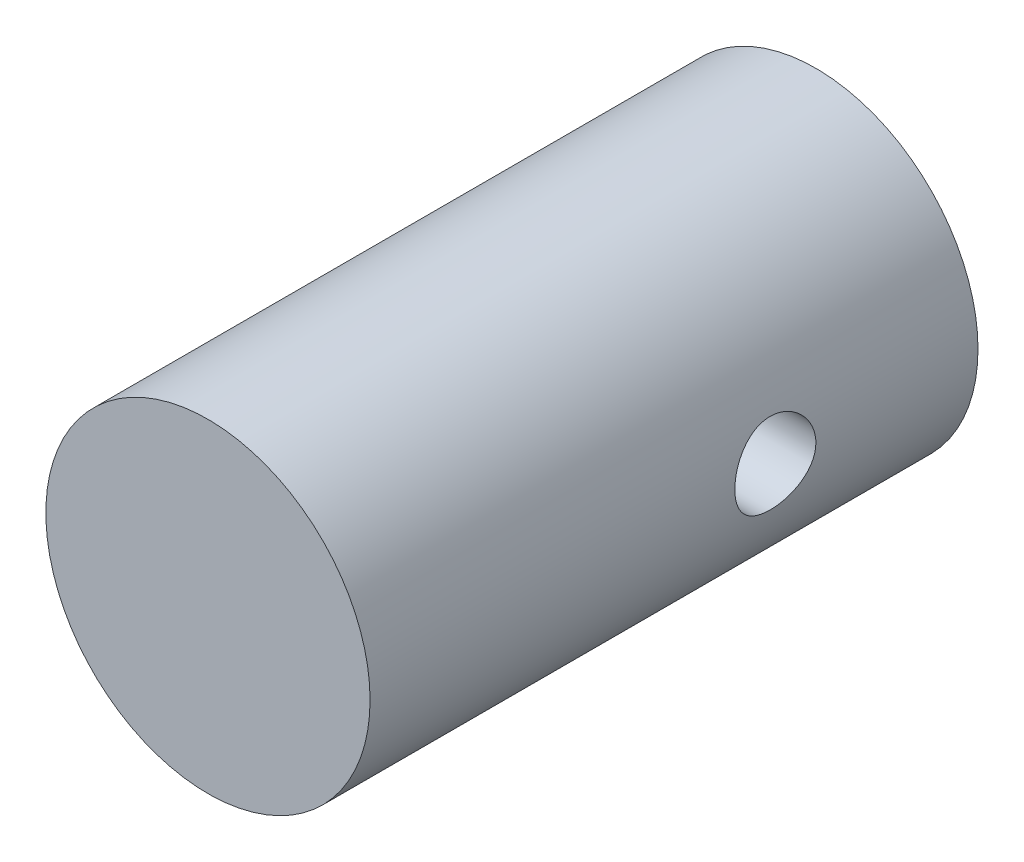
ISO-10303-21;
HEADER;
FILE_DESCRIPTION(('STEP AP214'),'2;1');
FILE_NAME('part.step','',(''),(''),'','','');
FILE_SCHEMA(('AUTOMOTIVE_DESIGN { 1 0 10303 214 1 1 1 1 }'));
ENDSEC;
DATA;
#1=APPLICATION_CONTEXT('core data for automotive mechanical design processes');
#2=APPLICATION_PROTOCOL_DEFINITION('international standard','automotive_design',2000,#1);
#3=PRODUCT_CONTEXT('',#1,'mechanical');
#4=PRODUCT('Part','Part','',(#3));
#5=PRODUCT_RELATED_PRODUCT_CATEGORY('part','',(#4));
#6=PRODUCT_DEFINITION_FORMATION('','',#4);
#7=PRODUCT_DEFINITION_CONTEXT('part definition',#1,'design');
#8=PRODUCT_DEFINITION('design','',#6,#7);
#9=PRODUCT_DEFINITION_SHAPE('','',#8);
#10=(LENGTH_UNIT() NAMED_UNIT(*) SI_UNIT(.MILLI.,.METRE.));
#11=(NAMED_UNIT(*) PLANE_ANGLE_UNIT() SI_UNIT($,.RADIAN.));
#12=(NAMED_UNIT(*) SI_UNIT($,.STERADIAN.) SOLID_ANGLE_UNIT());
#13=UNCERTAINTY_MEASURE_WITH_UNIT(LENGTH_MEASURE(1.E-05),#10,'distance_accuracy_value','');
#14=(GEOMETRIC_REPRESENTATION_CONTEXT(3) GLOBAL_UNCERTAINTY_ASSIGNED_CONTEXT((#13)) GLOBAL_UNIT_ASSIGNED_CONTEXT((#10,
#11,#12)) REPRESENTATION_CONTEXT('',''));
#15=CARTESIAN_POINT('',(0.,0.,0.));
#16=DIRECTION('',(0.,0.,1.));
#17=DIRECTION('',(1.,0.,0.));
#18=AXIS2_PLACEMENT_3D('',#15,#16,#17);
#19=CARTESIAN_POINT('',(-16.0700267929339,15.5717313885019,30.));
#20=DIRECTION('',(0.,0.,-1.));
#21=DIRECTION('',(-1.,0.,0.));
#22=AXIS2_PLACEMENT_3D('',#19,#20,#21);
#23=CYLINDRICAL_SURFACE('',#22,8.);
#24=CARTESIAN_POINT('',(-24.0700267929339,15.5717313885019,12.));
#25=CARTESIAN_POINT('',(-24.0700249245074,15.4612299369422,11.9999968990158));
#26=CARTESIAN_POINT('',(-24.0677145013583,15.3506938447275,11.990811265635));
#27=CARTESIAN_POINT('',(-24.0587216439992,15.1327896234745,11.954366464924));
#28=CARTESIAN_POINT('',(-24.0520367318669,15.0254233260075,11.9270970539495));
#29=CARTESIAN_POINT('',(-24.0350351440277,14.8170368922584,11.8554143287172));
#30=CARTESIAN_POINT('',(-24.024722830828,14.7160093039285,11.811021601713));
#31=CARTESIAN_POINT('',(-24.0015647103689,14.5228352126293,11.7064248132735));
#32=CARTESIAN_POINT('',(-23.988718817656,14.4306890093702,11.646220218508));
#33=CARTESIAN_POINT('',(-23.9615923074898,14.255995485434,11.5103989471278));
#34=CARTESIAN_POINT('',(-23.9472895549089,14.1736571350871,11.4345179000546));
#35=CARTESIAN_POINT('',(-23.9190083945064,14.0227328188974,11.270063726788));
#36=CARTESIAN_POINT('',(-23.9050300234655,13.9541484059029,11.1814891694041));
#37=CARTESIAN_POINT('',(-23.8787571355762,13.8316959981032,10.992539697684));
#38=CARTESIAN_POINT('',(-23.8664907191314,13.7780617672683,10.8920090255884));
#39=CARTESIAN_POINT('',(-23.8453533905075,13.6885355104342,10.6830021177866));
#40=CARTESIAN_POINT('',(-23.8364819355262,13.652640647915,10.5745271555573));
#41=CARTESIAN_POINT('',(-23.8233664822182,13.6003249394288,10.3550086690645));
#42=CARTESIAN_POINT('',(-23.8190333395607,13.5835283640591,10.244060138616));
#43=CARTESIAN_POINT('',(-23.8152182923951,13.5687156884133,10.0208419080009));
#44=CARTESIAN_POINT('',(-23.8157355986396,13.5706965327444,9.90857242574382));
#45=CARTESIAN_POINT('',(-23.8214828664915,13.5930826889823,9.6887789230062));
#46=CARTESIAN_POINT('',(-23.8265982996978,13.6130402682477,9.58120583804623));
#47=CARTESIAN_POINT('',(-23.8407829218815,13.6700991392979,9.37098526545192));
#48=CARTESIAN_POINT('',(-23.8498523925238,13.7072016524093,9.26833812929477));
#49=CARTESIAN_POINT('',(-23.871028311676,13.7978787512523,9.06968264499716));
#50=CARTESIAN_POINT('',(-23.8831644925315,13.8516158321913,8.97375177094724));
#51=CARTESIAN_POINT('',(-23.9090896042138,13.9739230204819,8.79210838699091));
#52=CARTESIAN_POINT('',(-23.9228788240623,14.0424957234234,8.70639766924367));
#53=CARTESIAN_POINT('',(-23.9510385334658,14.1948468222602,8.5450618457408));
#54=CARTESIAN_POINT('',(-23.9654143859739,14.2790030442807,8.46979401325153));
#55=CARTESIAN_POINT('',(-23.9927730006507,14.4589154984969,8.3343716767148));
#56=CARTESIAN_POINT('',(-24.0057557202594,14.5546720848913,8.27421763431525));
#57=CARTESIAN_POINT('',(-24.0289298875231,14.75557687026,8.17059921836749));
#58=CARTESIAN_POINT('',(-24.039111594637,14.860756197557,8.12719287966076));
#59=CARTESIAN_POINT('',(-24.0554656861528,15.0772300443113,8.05877692572057));
#60=CARTESIAN_POINT('',(-24.0616388374577,15.1885233896345,8.03376379144249));
#61=CARTESIAN_POINT('',(-24.0691667832189,15.4110114279818,8.00338991258822));
#62=CARTESIAN_POINT('',(-24.070640839711,15.5221357618509,7.9975426318996));
#63=CARTESIAN_POINT('',(-24.0689441904599,15.7437752215705,8.00433200274065));
#64=CARTESIAN_POINT('',(-24.0657739028252,15.8542904013613,8.01696699039885));
#65=CARTESIAN_POINT('',(-24.0552212079654,16.0698837468705,8.05996121118851));
#66=CARTESIAN_POINT('',(-24.0479019154114,16.1750182137935,8.09005501796932));
#67=CARTESIAN_POINT('',(-24.0298762147224,16.3787411117719,8.16680944537126));
#68=CARTESIAN_POINT('',(-24.0191694645325,16.4773288805454,8.21347173908423));
#69=CARTESIAN_POINT('',(-23.9952708986181,16.6670955677417,8.32298150516631));
#70=CARTESIAN_POINT('',(-23.9820383578264,16.7581119776163,8.38610148319568));
#71=CARTESIAN_POINT('',(-23.9546202487662,16.9284335400262,8.52638654506263));
#72=CARTESIAN_POINT('',(-23.94043451629,17.0077366671325,8.60355405282255));
#73=CARTESIAN_POINT('',(-23.9122795524109,17.1543854792655,8.77200261445929));
#74=CARTESIAN_POINT('',(-23.8983241820977,17.2213898786646,8.86358360400323));
#75=CARTESIAN_POINT('',(-23.8725985046304,17.3390790671855,9.05697684595429));
#76=CARTESIAN_POINT('',(-23.8608281004943,17.3897645807124,9.15878864394634));
#77=CARTESIAN_POINT('',(-23.8409347227295,17.4729999493142,9.36920762988411));
#78=CARTESIAN_POINT('',(-23.832790196826,17.5056572507073,9.47777017112535));
#79=CARTESIAN_POINT('',(-23.8210500474697,17.5521922684402,9.69907951718548));
#80=CARTESIAN_POINT('',(-23.8174534291997,17.5660740918067,9.81182540137666));
#81=CARTESIAN_POINT('',(-23.81529214232,17.5744495089472,10.0348280318069));
#82=CARTESIAN_POINT('',(-23.8165858959774,17.569488585542,10.145063246833));
#83=CARTESIAN_POINT('',(-23.8237322463718,17.5415677595857,10.3630718515573));
#84=CARTESIAN_POINT('',(-23.829584751492,17.5186082187509,10.4708452906849));
#85=CARTESIAN_POINT('',(-23.8451102687036,17.4556398144256,10.6802779454205));
#86=CARTESIAN_POINT('',(-23.8547603294181,17.415733261409,10.7819697403203));
#87=CARTESIAN_POINT('',(-23.876796869265,17.320084606642,10.9772871769516));
#88=CARTESIAN_POINT('',(-23.8891837278776,17.2643403085474,11.0709116975826));
#89=CARTESIAN_POINT('',(-23.9157019164474,17.1368883866847,11.2500728386694));
#90=CARTESIAN_POINT('',(-23.929870324024,17.0648022723849,11.3353347645653));
#91=CARTESIAN_POINT('',(-23.9581338228844,16.9074505500882,11.4927293930605));
#92=CARTESIAN_POINT('',(-23.9722288959614,16.8221818168501,11.564858973484));
#93=CARTESIAN_POINT('',(-23.9990622015694,16.6390215041053,11.6952150780861));
#94=CARTESIAN_POINT('',(-24.0117712378122,16.5409292849237,11.7531661515621));
#95=CARTESIAN_POINT('',(-24.0340924592688,16.3360861345158,11.8516632839207));
#96=CARTESIAN_POINT('',(-24.0437068622643,16.2293414730842,11.892221814198));
#97=CARTESIAN_POINT('',(-24.0573342538078,16.0309450594932,11.9487624404395));
#98=CARTESIAN_POINT('',(-24.0620612603031,15.940238283046,11.9679349907379));
#99=CARTESIAN_POINT('',(-24.0684081960266,15.7569394838836,11.9935545914959));
#100=CARTESIAN_POINT('',(-24.0700283589459,15.664347603492,12.0000025990737));
#101=CARTESIAN_POINT('',(-24.0700267929339,15.5717313885019,12.));
#102=B_SPLINE_CURVE_WITH_KNOTS('',3,(#24,#25,#26,#27,#28,#29,#30,#31,#32,#33,#34,#35,#36,#37,
#38,#39,#40,#41,#42,#43,#44,#45,#46,#47,#48,#49,#50,#51,#52,#53,#54,#55,#56,#57,#58,#59,#60,#61,
#62,#63,#64,#65,#66,#67,#68,#69,#70,#71,#72,#73,#74,#75,#76,#77,#78,#79,#80,#81,#82,#83,#84,#85,
#86,#87,#88,#89,#90,#91,#92,#93,#94,#95,#96,#97,#98,#99,#100,#101),.UNSPECIFIED.,.T.,.F.,(4,2,2,
2,2,2,2,2,2,2,2,2,2,2,2,2,2,2,2,2,2,2,2,2,2,2,2,2,2,2,2,2,2,2,2,2,2,2,4),(0.,0.33116494996252,
0.662517650351867,0.993473203048143,1.32443992022577,1.66152580582852,1.99864972773416,
2.34078196727743,2.68285948225825,3.01808393468093,3.3532538415469,3.68029996013785,
4.00736937959146,4.337740371696,4.66816921119312,5.00802001296454,5.34788119415424,
5.6889097201658,6.02987298255951,6.36211078603462,6.69431868154751,7.02160366023144,
7.34892169767481,7.68204783424897,8.01523150681786,8.35659345610395,8.69794025003772,
9.03723006156476,9.37644564340971,9.70591707202577,10.0353818794581,10.3628853408369,
10.6904342418696,11.0265276855097,11.3627009303165,11.7049624733721,12.0469781843289,
12.3245632392729,12.6021274139515),.UNSPECIFIED.);
#103=CARTESIAN_POINT('',(-24.0700267929339,15.5717313885019,12.));
#104=VERTEX_POINT('',#103);
#105=EDGE_CURVE('E37',#104,#104,#102,.T.);
#106=ORIENTED_EDGE('',*,*,#105,.T.);
#107=EDGE_LOOP('',(#106));
#108=FACE_BOUND('',#107,.T.);
#109=CARTESIAN_POINT('',(-8.07002679293393,15.5717313885019,8.));
#110=CARTESIAN_POINT('',(-8.07002866136043,15.4612299369422,8.00000310098421));
#111=CARTESIAN_POINT('',(-8.07233908450958,15.3506938447275,8.00918873436505));
#112=CARTESIAN_POINT('',(-8.08133194186867,15.1327896234745,8.04563353507601));
#113=CARTESIAN_POINT('',(-8.08801685400091,15.0254233260075,8.07290294605047));
#114=CARTESIAN_POINT('',(-8.10501844184016,14.8170368922584,8.14458567128278));
#115=CARTESIAN_POINT('',(-8.11533075503982,14.7160093039285,8.18897839828703));
#116=CARTESIAN_POINT('',(-8.13848887549898,14.5228352126293,8.29357518672646));
#117=CARTESIAN_POINT('',(-8.15133476821184,14.4306890093702,8.35377978149196));
#118=CARTESIAN_POINT('',(-8.17846127837802,14.255995485434,8.48960105287224));
#119=CARTESIAN_POINT('',(-8.19276403095891,14.1736571350871,8.56548209994542));
#120=CARTESIAN_POINT('',(-8.22104519136144,14.0227328188974,8.72993627321205));
#121=CARTESIAN_POINT('',(-8.23502356240236,13.9541484059029,8.81851083059592));
#122=CARTESIAN_POINT('',(-8.26129645029168,13.8316959981032,9.00746030231599));
#123=CARTESIAN_POINT('',(-8.27356286673645,13.7780617672683,9.10799097441164));
#124=CARTESIAN_POINT('',(-8.29470019536038,13.6885355104342,9.31699788221338));
#125=CARTESIAN_POINT('',(-8.30357165034168,13.652640647915,9.42547284444269));
#126=CARTESIAN_POINT('',(-8.31668710364962,13.6003249394288,9.64499133093555));
#127=CARTESIAN_POINT('',(-8.32102024630711,13.5835283640591,9.75593986138399));
#128=CARTESIAN_POINT('',(-8.32483529347271,13.5687156884133,9.97915809199913));
#129=CARTESIAN_POINT('',(-8.32431798722821,13.5706965327444,10.0914275742562));
#130=CARTESIAN_POINT('',(-8.31857071937637,13.5930826889823,10.3112210769938));
#131=CARTESIAN_POINT('',(-8.31345528617001,13.6130402682477,10.4187941619538));
#132=CARTESIAN_POINT('',(-8.29927066398634,13.6700991392979,10.6290147345481));
#133=CARTESIAN_POINT('',(-8.29020119334408,13.7072016524093,10.7316618707052));
#134=CARTESIAN_POINT('',(-8.26902527419181,13.7978787512523,10.9303173550028));
#135=CARTESIAN_POINT('',(-8.25688909333638,13.8516158321913,11.0262482290528));
#136=CARTESIAN_POINT('',(-8.23096398165405,13.9739230204819,11.2078916130091));
#137=CARTESIAN_POINT('',(-8.21717476180555,14.0424957234234,11.2936023307563));
#138=CARTESIAN_POINT('',(-8.18901505240204,14.1948468222602,11.4549381542592));
#139=CARTESIAN_POINT('',(-8.17463919989391,14.2790030442807,11.5302059867485));
#140=CARTESIAN_POINT('',(-8.14728058521718,14.4589154984969,11.6656283232852));
#141=CARTESIAN_POINT('',(-8.1342978656085,14.5546720848913,11.7257823656848));
#142=CARTESIAN_POINT('',(-8.11112369834472,14.75557687026,11.8294007816325));
#143=CARTESIAN_POINT('',(-8.1009419912309,14.860756197557,11.8728071203392));
#144=CARTESIAN_POINT('',(-8.08458789971504,15.0772300443113,11.9412230742794));
#145=CARTESIAN_POINT('',(-8.07841474841019,15.1885233896345,11.9662362085575));
#146=CARTESIAN_POINT('',(-8.07088680264893,15.4110114279818,11.9966100874118));
#147=CARTESIAN_POINT('',(-8.06941274615688,15.5221357618509,12.0024573681004));
#148=CARTESIAN_POINT('',(-8.07110939540792,15.7437752215705,11.9956679972594));
#149=CARTESIAN_POINT('',(-8.07427968304264,15.8542904013613,11.9830330096012));
#150=CARTESIAN_POINT('',(-8.0848323779025,16.0698837468705,11.9400387888115));
#151=CARTESIAN_POINT('',(-8.09215167045644,16.1750182137935,11.9099449820307));
#152=CARTESIAN_POINT('',(-8.11017737114547,16.3787411117719,11.8331905546287));
#153=CARTESIAN_POINT('',(-8.12088412133536,16.4773288805454,11.7865282609158));
#154=CARTESIAN_POINT('',(-8.14478268724979,16.6670955677417,11.6770184948337));
#155=CARTESIAN_POINT('',(-8.1580152280415,16.7581119776163,11.6138985168043));
#156=CARTESIAN_POINT('',(-8.18543333710167,16.9284335400262,11.4736134549374));
#157=CARTESIAN_POINT('',(-8.19961906957786,17.0077366671325,11.3964459471775));
#158=CARTESIAN_POINT('',(-8.22777403345698,17.1543854792655,11.2279973855407));
#159=CARTESIAN_POINT('',(-8.24172940377018,17.2213898786646,11.1364163959968));
#160=CARTESIAN_POINT('',(-8.26745508123741,17.3390790671855,10.9430231540457));
#161=CARTESIAN_POINT('',(-8.27922548537358,17.3897645807124,10.8412113560537));
#162=CARTESIAN_POINT('',(-8.29911886313839,17.4729999493142,10.6307923701159));
#163=CARTESIAN_POINT('',(-8.30726338904185,17.5056572507073,10.5222298288747));
#164=CARTESIAN_POINT('',(-8.31900353839815,17.5521922684402,10.3009204828145));
#165=CARTESIAN_POINT('',(-8.32260015666811,17.5660740918067,10.1881745986233));
#166=CARTESIAN_POINT('',(-8.32476144354784,17.5744495089472,9.96517196819306));
#167=CARTESIAN_POINT('',(-8.32346768989041,17.569488585542,9.85493675316703));
#168=CARTESIAN_POINT('',(-8.31632133949602,17.5415677595857,9.63692814844269));
#169=CARTESIAN_POINT('',(-8.31046883437584,17.5186082187509,9.52915470931513));
#170=CARTESIAN_POINT('',(-8.29494331716429,17.4556398144256,9.31972205457945));
#171=CARTESIAN_POINT('',(-8.2852932564498,17.415733261409,9.21803025967972));
#172=CARTESIAN_POINT('',(-8.26325671660288,17.3200846066419,9.02271282304841));
#173=CARTESIAN_POINT('',(-8.25086985799028,17.2643403085474,8.92908830241744));
#174=CARTESIAN_POINT('',(-8.22435166942043,17.1368883866847,8.74992716133064));
#175=CARTESIAN_POINT('',(-8.21018326184383,17.0648022723849,8.66466523543472));
#176=CARTESIAN_POINT('',(-8.18191976298345,16.9074505500882,8.50727060693946));
#177=CARTESIAN_POINT('',(-8.16782468990646,16.8221818168501,8.43514102651604));
#178=CARTESIAN_POINT('',(-8.14099138429842,16.6390215041053,8.30478492191386));
#179=CARTESIAN_POINT('',(-8.12828234805569,16.5409292849237,8.2468338484379));
#180=CARTESIAN_POINT('',(-8.10596112659902,16.3360861345158,8.14833671607929));
#181=CARTESIAN_POINT('',(-8.09634672360351,16.2293414730842,8.10777818580195));
#182=CARTESIAN_POINT('',(-8.08271933206004,16.0309450594932,8.05123755956046));
#183=CARTESIAN_POINT('',(-8.07799232556472,15.940238283046,8.03206500926209));
#184=CARTESIAN_POINT('',(-8.07164538984128,15.7569394838836,8.00644540850408));
#185=CARTESIAN_POINT('',(-8.070025226922,15.664347603492,7.99999740092627));
#186=CARTESIAN_POINT('',(-8.07002679293393,15.5717313885019,8.));
#187=B_SPLINE_CURVE_WITH_KNOTS('',3,(#109,#110,#111,#112,#113,#114,#115,#116,#117,#118,#119,
#120,#121,#122,#123,#124,#125,#126,#127,#128,#129,#130,#131,#132,#133,#134,#135,#136,#137,#138,
#139,#140,#141,#142,#143,#144,#145,#146,#147,#148,#149,#150,#151,#152,#153,#154,#155,#156,#157,
#158,#159,#160,#161,#162,#163,#164,#165,#166,#167,#168,#169,#170,#171,#172,#173,#174,#175,#176,
#177,#178,#179,#180,#181,#182,#183,#184,#185,#186),.UNSPECIFIED.,.T.,.F.,(4,2,2,2,2,2,2,2,2,2,2,
2,2,2,2,2,2,2,2,2,2,2,2,2,2,2,2,2,2,2,2,2,2,2,2,2,2,2,4),(0.,0.33116494996252,0.662517650351867,
0.993473203048142,1.32443992022577,1.66152580582852,1.99864972773416,2.34078196727743,
2.68285948225824,3.01808393468093,3.3532538415469,3.68029996013785,4.00736937959146,
4.337740371696,4.66816921119311,5.00802001296453,5.34788119415424,5.6889097201658,
6.02987298255951,6.36211078603462,6.69431868154751,7.02160366023143,7.34892169767481,
7.68204783424897,8.01523150681786,8.35659345610395,8.69794025003772,9.03723006156476,
9.37644564340971,9.70591707202577,10.0353818794581,10.3628853408369,10.6904342418696,
11.0265276855097,11.3627009303165,11.7049624733721,12.0469781843289,12.3245632392729,
12.6021274139515),.UNSPECIFIED.);
#188=CARTESIAN_POINT('',(-8.07002679293393,15.5717313885019,8.));
#189=VERTEX_POINT('',#188);
#190=EDGE_CURVE('E50',#189,#189,#187,.T.);
#191=ORIENTED_EDGE('',*,*,#190,.T.);
#192=EDGE_LOOP('',(#191));
#193=FACE_BOUND('',#192,.T.);
#194=CARTESIAN_POINT('',(-16.0700267929339,15.5717313885019,30.));
#195=DIRECTION('',(0.,0.,1.));
#196=DIRECTION('',(1.,0.,0.));
#197=AXIS2_PLACEMENT_3D('',#194,#195,#196);
#198=CIRCLE('',#197,8.);
#199=CARTESIAN_POINT('',(-8.07002679293393,15.5717313885019,30.));
#200=VERTEX_POINT('',#199);
#201=EDGE_CURVE('E10',#200,#200,#198,.T.);
#202=ORIENTED_EDGE('',*,*,#201,.F.);
#203=EDGE_LOOP('',(#202));
#204=FACE_BOUND('',#203,.T.);
#205=CARTESIAN_POINT('',(-16.0700267929339,15.5717313885019,0.));
#206=DIRECTION('',(0.,0.,1.));
#207=DIRECTION('',(1.,0.,0.));
#208=AXIS2_PLACEMENT_3D('',#205,#206,#207);
#209=CIRCLE('',#208,8.);
#210=CARTESIAN_POINT('',(-8.07002679293393,15.5717313885019,0.));
#211=VERTEX_POINT('',#210);
#212=EDGE_CURVE('E44',#211,#211,#209,.T.);
#213=ORIENTED_EDGE('',*,*,#212,.T.);
#214=EDGE_LOOP('',(#213));
#215=FACE_BOUND('',#214,.T.);
#216=ADVANCED_FACE('F33',(#108,#193,#204,#215),#23,.T.);
#217=CARTESIAN_POINT('',(-16.0700267929339,15.5717313885019,30.));
#218=DIRECTION('',(0.,0.,1.));
#219=DIRECTION('',(1.,0.,0.));
#220=AXIS2_PLACEMENT_3D('',#217,#218,#219);
#221=PLANE('',#220);
#222=ORIENTED_EDGE('',*,*,#201,.T.);
#223=EDGE_LOOP('',(#222));
#224=FACE_BOUND('',#223,.T.);
#225=ADVANCED_FACE('F60',(#224),#221,.T.);
#226=CARTESIAN_POINT('',(-16.0700267929339,15.5717313885019,0.));
#227=DIRECTION('',(0.,0.,1.));
#228=DIRECTION('',(1.,0.,0.));
#229=AXIS2_PLACEMENT_3D('',#226,#227,#228);
#230=PLANE('',#229);
#231=ORIENTED_EDGE('',*,*,#212,.F.);
#232=EDGE_LOOP('',(#231));
#233=FACE_BOUND('',#232,.T.);
#234=ADVANCED_FACE('F58',(#233),#230,.F.);
#235=CARTESIAN_POINT('',(-31.,15.5717313885019,10.));
#236=DIRECTION('',(1.,0.,0.));
#237=DIRECTION('',(0.,0.,-1.));
#238=AXIS2_PLACEMENT_3D('',#235,#236,#237);
#239=CYLINDRICAL_SURFACE('',#238,2.);
#240=ORIENTED_EDGE('',*,*,#190,.F.);
#241=EDGE_LOOP('',(#240));
#242=FACE_BOUND('',#241,.T.);
#243=ORIENTED_EDGE('',*,*,#105,.F.);
#244=EDGE_LOOP('',(#243));
#245=FACE_BOUND('',#244,.T.);
#246=ADVANCED_FACE('F54',(#242,#245),#239,.F.);
#247=CLOSED_SHELL('',(#216,#225,#234,#246));
#248=MANIFOLD_SOLID_BREP('B2',#247);
#249=ADVANCED_BREP_SHAPE_REPRESENTATION('',(#18,#248),#14);
#250=SHAPE_DEFINITION_REPRESENTATION(#9,#249);
ENDSEC;
END-ISO-10303-21;
